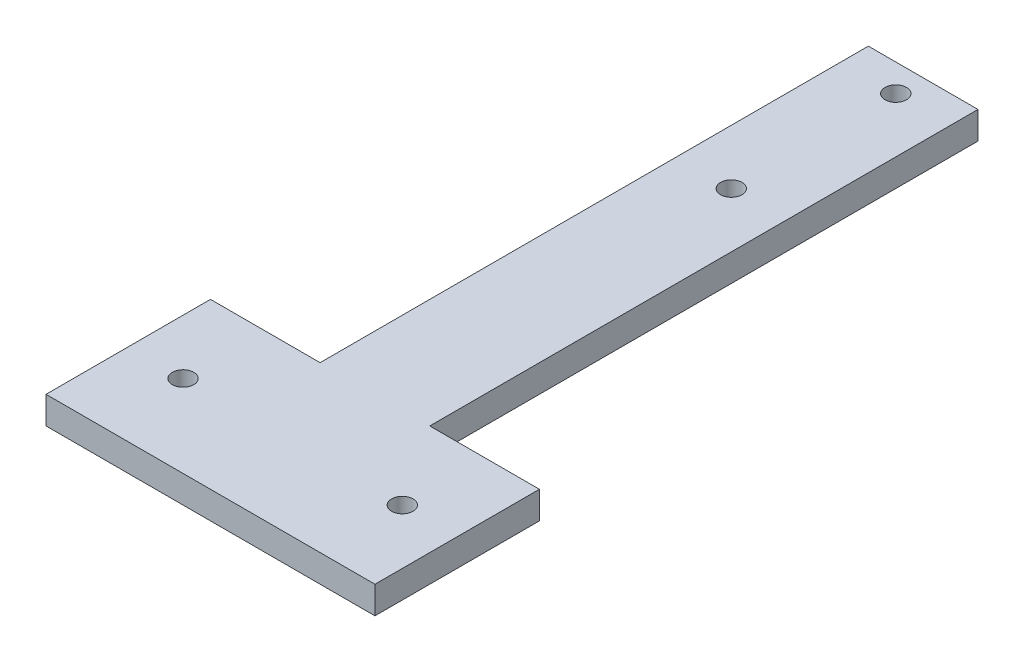
ISO-10303-21;
HEADER;
FILE_DESCRIPTION(('STEP AP214'),'2;1');
FILE_NAME('part.step','',(''),(''),'','','');
FILE_SCHEMA(('AUTOMOTIVE_DESIGN { 1 0 10303 214 1 1 1 1 }'));
ENDSEC;
DATA;
#1=APPLICATION_CONTEXT('core data for automotive mechanical design processes');
#2=APPLICATION_PROTOCOL_DEFINITION('international standard','automotive_design',2000,#1);
#3=PRODUCT_CONTEXT('',#1,'mechanical');
#4=PRODUCT('Part','Part','',(#3));
#5=PRODUCT_RELATED_PRODUCT_CATEGORY('part','',(#4));
#6=PRODUCT_DEFINITION_FORMATION('','',#4);
#7=PRODUCT_DEFINITION_CONTEXT('part definition',#1,'design');
#8=PRODUCT_DEFINITION('design','',#6,#7);
#9=PRODUCT_DEFINITION_SHAPE('','',#8);
#10=(LENGTH_UNIT() NAMED_UNIT(*) SI_UNIT(.MILLI.,.METRE.));
#11=(NAMED_UNIT(*) PLANE_ANGLE_UNIT() SI_UNIT($,.RADIAN.));
#12=(NAMED_UNIT(*) SI_UNIT($,.STERADIAN.) SOLID_ANGLE_UNIT());
#13=UNCERTAINTY_MEASURE_WITH_UNIT(LENGTH_MEASURE(1.E-05),#10,'distance_accuracy_value','');
#14=(GEOMETRIC_REPRESENTATION_CONTEXT(3) GLOBAL_UNCERTAINTY_ASSIGNED_CONTEXT((#13)) GLOBAL_UNIT_ASSIGNED_CONTEXT((#10,
#11,#12)) REPRESENTATION_CONTEXT('',''));
#15=CARTESIAN_POINT('',(0.,0.,0.));
#16=DIRECTION('',(0.,0.,1.));
#17=DIRECTION('',(1.,0.,0.));
#18=AXIS2_PLACEMENT_3D('',#15,#16,#17);
#19=CARTESIAN_POINT('',(0.,6.35,0.));
#20=DIRECTION('',(0.,1.,0.));
#21=DIRECTION('',(0.,0.,1.));
#22=AXIS2_PLACEMENT_3D('',#19,#20,#21);
#23=PLANE('',#22);
#24=CARTESIAN_POINT('',(0.,6.35,-158.75));
#25=DIRECTION('',(0.,1.,0.));
#26=DIRECTION('',(0.,0.,1.));
#27=AXIS2_PLACEMENT_3D('',#24,#25,#26);
#28=CIRCLE('',#27,2.48920000000003);
#29=CARTESIAN_POINT('',(0.,6.35,-156.2608));
#30=VERTEX_POINT('',#29);
#31=EDGE_CURVE('E189',#30,#30,#28,.T.);
#32=ORIENTED_EDGE('',*,*,#31,.F.);
#33=EDGE_LOOP('',(#32));
#34=FACE_BOUND('',#33,.T.);
#35=CARTESIAN_POINT('',(-25.4,6.35,-19.05));
#36=DIRECTION('',(0.,1.,0.));
#37=DIRECTION('',(0.,0.,1.));
#38=AXIS2_PLACEMENT_3D('',#35,#36,#37);
#39=CIRCLE('',#38,2.4892);
#40=CARTESIAN_POINT('',(-25.4,6.35,-16.5608));
#41=VERTEX_POINT('',#40);
#42=EDGE_CURVE('E135',#41,#41,#39,.T.);
#43=ORIENTED_EDGE('',*,*,#42,.F.);
#44=EDGE_LOOP('',(#43));
#45=FACE_BOUND('',#44,.T.);
#46=DIRECTION('',(-1.,0.,0.));
#47=VECTOR('',#46,1.);
#48=CARTESIAN_POINT('',(12.7,6.35,-165.1));
#49=LINE('',#48,#47);
#50=CARTESIAN_POINT('',(12.7,6.35,-165.1));
#51=VERTEX_POINT('',#50);
#52=CARTESIAN_POINT('',(-12.7,6.35,-165.1));
#53=VERTEX_POINT('',#52);
#54=EDGE_CURVE('E146',#51,#53,#49,.T.);
#55=ORIENTED_EDGE('',*,*,#54,.T.);
#56=DIRECTION('',(0.,0.,1.));
#57=VECTOR('',#56,1.);
#58=CARTESIAN_POINT('',(-12.7,6.35,-165.1));
#59=LINE('',#58,#57);
#60=CARTESIAN_POINT('',(-12.7,6.35,-38.1));
#61=VERTEX_POINT('',#60);
#62=EDGE_CURVE('E94',#53,#61,#59,.T.);
#63=ORIENTED_EDGE('',*,*,#62,.T.);
#64=DIRECTION('',(-1.,0.,0.));
#65=VECTOR('',#64,1.);
#66=CARTESIAN_POINT('',(-12.7,6.35,-38.1));
#67=LINE('',#66,#65);
#68=CARTESIAN_POINT('',(-38.1,6.35,-38.1));
#69=VERTEX_POINT('',#68);
#70=EDGE_CURVE('E161',#61,#69,#67,.T.);
#71=ORIENTED_EDGE('',*,*,#70,.T.);
#72=DIRECTION('',(0.,0.,1.));
#73=VECTOR('',#72,1.);
#74=CARTESIAN_POINT('',(-38.1,6.35,-38.1));
#75=LINE('',#74,#73);
#76=CARTESIAN_POINT('',(-38.1,6.35,0.));
#77=VERTEX_POINT('',#76);
#78=EDGE_CURVE('E174',#69,#77,#75,.T.);
#79=ORIENTED_EDGE('',*,*,#78,.T.);
#80=DIRECTION('',(1.,0.,0.));
#81=VECTOR('',#80,1.);
#82=CARTESIAN_POINT('',(-38.1,6.35,0.));
#83=LINE('',#82,#81);
#84=CARTESIAN_POINT('',(38.1,6.35,0.));
#85=VERTEX_POINT('',#84);
#86=EDGE_CURVE('E113',#77,#85,#83,.T.);
#87=ORIENTED_EDGE('',*,*,#86,.T.);
#88=DIRECTION('',(0.,0.,-1.));
#89=VECTOR('',#88,1.);
#90=CARTESIAN_POINT('',(38.1,6.35,0.));
#91=LINE('',#90,#89);
#92=CARTESIAN_POINT('',(38.1,6.35,-38.1));
#93=VERTEX_POINT('',#92);
#94=EDGE_CURVE('E107',#85,#93,#91,.T.);
#95=ORIENTED_EDGE('',*,*,#94,.T.);
#96=DIRECTION('',(-1.,0.,0.));
#97=VECTOR('',#96,1.);
#98=CARTESIAN_POINT('',(38.1,6.35,-38.1));
#99=LINE('',#98,#97);
#100=CARTESIAN_POINT('',(12.7,6.35,-38.1));
#101=VERTEX_POINT('',#100);
#102=EDGE_CURVE('E111',#93,#101,#99,.T.);
#103=ORIENTED_EDGE('',*,*,#102,.T.);
#104=DIRECTION('',(0.,0.,-1.));
#105=VECTOR('',#104,1.);
#106=CARTESIAN_POINT('',(12.7,6.35,-38.1));
#107=LINE('',#106,#105);
#108=EDGE_CURVE('E51',#101,#51,#107,.T.);
#109=ORIENTED_EDGE('',*,*,#108,.T.);
#110=EDGE_LOOP('',(#55,#63,#71,#79,#87,#95,#103,#109));
#111=FACE_BOUND('',#110,.T.);
#112=CARTESIAN_POINT('',(25.4,6.35,-19.05));
#113=DIRECTION('',(0.,1.,0.));
#114=DIRECTION('',(0.,0.,1.));
#115=AXIS2_PLACEMENT_3D('',#112,#113,#114);
#116=CIRCLE('',#115,2.4892);
#117=CARTESIAN_POINT('',(25.4,6.35,-16.5608));
#118=VERTEX_POINT('',#117);
#119=EDGE_CURVE('E183',#118,#118,#116,.T.);
#120=ORIENTED_EDGE('',*,*,#119,.F.);
#121=EDGE_LOOP('',(#120));
#122=FACE_BOUND('',#121,.T.);
#123=CARTESIAN_POINT('',(0.,6.35,-120.65));
#124=DIRECTION('',(0.,1.,0.));
#125=DIRECTION('',(0.,0.,1.));
#126=AXIS2_PLACEMENT_3D('',#123,#124,#125);
#127=CIRCLE('',#126,2.4892);
#128=CARTESIAN_POINT('',(0.,6.35,-118.1608));
#129=VERTEX_POINT('',#128);
#130=EDGE_CURVE('E195',#129,#129,#127,.T.);
#131=ORIENTED_EDGE('',*,*,#130,.F.);
#132=EDGE_LOOP('',(#131));
#133=FACE_BOUND('',#132,.T.);
#134=ADVANCED_FACE('F34',(#34,#45,#111,#122,#133),#23,.T.);
#135=CARTESIAN_POINT('',(0.,0.,0.));
#136=DIRECTION('',(0.,1.,0.));
#137=DIRECTION('',(0.,0.,1.));
#138=AXIS2_PLACEMENT_3D('',#135,#136,#137);
#139=PLANE('',#138);
#140=DIRECTION('',(-1.,0.,0.));
#141=VECTOR('',#140,1.);
#142=CARTESIAN_POINT('',(12.7,0.,-165.1));
#143=LINE('',#142,#141);
#144=CARTESIAN_POINT('',(12.7,0.,-165.1));
#145=VERTEX_POINT('',#144);
#146=CARTESIAN_POINT('',(-12.7,0.,-165.1));
#147=VERTEX_POINT('',#146);
#148=EDGE_CURVE('E131',#145,#147,#143,.T.);
#149=ORIENTED_EDGE('',*,*,#148,.F.);
#150=DIRECTION('',(0.,0.,-1.));
#151=VECTOR('',#150,1.);
#152=CARTESIAN_POINT('',(12.7,0.,-38.1));
#153=LINE('',#152,#151);
#154=CARTESIAN_POINT('',(12.7,0.,-38.1));
#155=VERTEX_POINT('',#154);
#156=EDGE_CURVE('E86',#155,#145,#153,.T.);
#157=ORIENTED_EDGE('',*,*,#156,.F.);
#158=DIRECTION('',(-1.,0.,0.));
#159=VECTOR('',#158,1.);
#160=CARTESIAN_POINT('',(38.1,0.,-38.1));
#161=LINE('',#160,#159);
#162=CARTESIAN_POINT('',(38.1,0.,-38.1));
#163=VERTEX_POINT('',#162);
#164=EDGE_CURVE('E80',#163,#155,#161,.T.);
#165=ORIENTED_EDGE('',*,*,#164,.F.);
#166=DIRECTION('',(0.,0.,-1.));
#167=VECTOR('',#166,1.);
#168=CARTESIAN_POINT('',(38.1,0.,0.));
#169=LINE('',#168,#167);
#170=CARTESIAN_POINT('',(38.1,0.,0.));
#171=VERTEX_POINT('',#170);
#172=EDGE_CURVE('E121',#171,#163,#169,.T.);
#173=ORIENTED_EDGE('',*,*,#172,.F.);
#174=DIRECTION('',(1.,0.,0.));
#175=VECTOR('',#174,1.);
#176=CARTESIAN_POINT('',(-38.1,0.,0.));
#177=LINE('',#176,#175);
#178=CARTESIAN_POINT('',(-38.1,0.,0.));
#179=VERTEX_POINT('',#178);
#180=EDGE_CURVE('E141',#179,#171,#177,.T.);
#181=ORIENTED_EDGE('',*,*,#180,.F.);
#182=DIRECTION('',(0.,0.,1.));
#183=VECTOR('',#182,1.);
#184=CARTESIAN_POINT('',(-38.1,0.,-38.1));
#185=LINE('',#184,#183);
#186=CARTESIAN_POINT('',(-38.1,0.,-38.1));
#187=VERTEX_POINT('',#186);
#188=EDGE_CURVE('E139',#187,#179,#185,.T.);
#189=ORIENTED_EDGE('',*,*,#188,.F.);
#190=DIRECTION('',(-1.,0.,0.));
#191=VECTOR('',#190,1.);
#192=CARTESIAN_POINT('',(-12.7,0.,-38.1));
#193=LINE('',#192,#191);
#194=CARTESIAN_POINT('',(-12.7,0.,-38.1));
#195=VERTEX_POINT('',#194);
#196=EDGE_CURVE('E137',#195,#187,#193,.T.);
#197=ORIENTED_EDGE('',*,*,#196,.F.);
#198=DIRECTION('',(0.,0.,1.));
#199=VECTOR('',#198,1.);
#200=CARTESIAN_POINT('',(-12.7,0.,-165.1));
#201=LINE('',#200,#199);
#202=EDGE_CURVE('E134',#147,#195,#201,.T.);
#203=ORIENTED_EDGE('',*,*,#202,.F.);
#204=EDGE_LOOP('',(#149,#157,#165,#173,#181,#189,#197,#203));
#205=FACE_BOUND('',#204,.T.);
#206=CARTESIAN_POINT('',(-25.4,0.,-19.05));
#207=DIRECTION('',(0.,1.,0.));
#208=DIRECTION('',(0.,0.,1.));
#209=AXIS2_PLACEMENT_3D('',#206,#207,#208);
#210=CIRCLE('',#209,2.4892);
#211=CARTESIAN_POINT('',(-25.4,0.,-16.5608));
#212=VERTEX_POINT('',#211);
#213=EDGE_CURVE('E180',#212,#212,#210,.T.);
#214=ORIENTED_EDGE('',*,*,#213,.T.);
#215=EDGE_LOOP('',(#214));
#216=FACE_BOUND('',#215,.T.);
#217=CARTESIAN_POINT('',(25.4,0.,-19.05));
#218=DIRECTION('',(0.,1.,0.));
#219=DIRECTION('',(0.,0.,1.));
#220=AXIS2_PLACEMENT_3D('',#217,#218,#219);
#221=CIRCLE('',#220,2.4892);
#222=CARTESIAN_POINT('',(25.4,0.,-16.5608));
#223=VERTEX_POINT('',#222);
#224=EDGE_CURVE('E186',#223,#223,#221,.T.);
#225=ORIENTED_EDGE('',*,*,#224,.T.);
#226=EDGE_LOOP('',(#225));
#227=FACE_BOUND('',#226,.T.);
#228=CARTESIAN_POINT('',(0.,0.,-158.75));
#229=DIRECTION('',(0.,1.,0.));
#230=DIRECTION('',(0.,0.,1.));
#231=AXIS2_PLACEMENT_3D('',#228,#229,#230);
#232=CIRCLE('',#231,2.48920000000003);
#233=CARTESIAN_POINT('',(0.,0.,-156.2608));
#234=VERTEX_POINT('',#233);
#235=EDGE_CURVE('E192',#234,#234,#232,.T.);
#236=ORIENTED_EDGE('',*,*,#235,.T.);
#237=EDGE_LOOP('',(#236));
#238=FACE_BOUND('',#237,.T.);
#239=CARTESIAN_POINT('',(0.,0.,-120.65));
#240=DIRECTION('',(0.,1.,0.));
#241=DIRECTION('',(0.,0.,1.));
#242=AXIS2_PLACEMENT_3D('',#239,#240,#241);
#243=CIRCLE('',#242,2.4892);
#244=CARTESIAN_POINT('',(0.,0.,-118.1608));
#245=VERTEX_POINT('',#244);
#246=EDGE_CURVE('E198',#245,#245,#243,.T.);
#247=ORIENTED_EDGE('',*,*,#246,.T.);
#248=EDGE_LOOP('',(#247));
#249=FACE_BOUND('',#248,.T.);
#250=ADVANCED_FACE('F165',(#205,#216,#227,#238,#249),#139,.F.);
#251=CARTESIAN_POINT('',(12.7,6.35,-165.1));
#252=DIRECTION('',(0.,0.,1.));
#253=DIRECTION('',(1.,0.,0.));
#254=AXIS2_PLACEMENT_3D('',#251,#252,#253);
#255=PLANE('',#254);
#256=ORIENTED_EDGE('',*,*,#148,.T.);
#257=DIRECTION('',(0.,-1.,0.));
#258=VECTOR('',#257,1.);
#259=CARTESIAN_POINT('',(-12.7,6.35,-165.1));
#260=LINE('',#259,#258);
#261=EDGE_CURVE('E11',#53,#147,#260,.T.);
#262=ORIENTED_EDGE('',*,*,#261,.F.);
#263=ORIENTED_EDGE('',*,*,#54,.F.);
#264=DIRECTION('',(0.,-1.,0.));
#265=VECTOR('',#264,1.);
#266=CARTESIAN_POINT('',(12.7,6.35,-165.1));
#267=LINE('',#266,#265);
#268=EDGE_CURVE('E127',#51,#145,#267,.T.);
#269=ORIENTED_EDGE('',*,*,#268,.T.);
#270=EDGE_LOOP('',(#256,#262,#263,#269));
#271=FACE_BOUND('',#270,.T.);
#272=ADVANCED_FACE('F36',(#271),#255,.F.);
#273=CARTESIAN_POINT('',(-12.7,6.35,-165.1));
#274=DIRECTION('',(1.,0.,0.));
#275=DIRECTION('',(0.,0.,-1.));
#276=AXIS2_PLACEMENT_3D('',#273,#274,#275);
#277=PLANE('',#276);
#278=ORIENTED_EDGE('',*,*,#202,.T.);
#279=DIRECTION('',(0.,-1.,0.));
#280=VECTOR('',#279,1.);
#281=CARTESIAN_POINT('',(-12.7,6.35,-38.1));
#282=LINE('',#281,#280);
#283=EDGE_CURVE('E43',#61,#195,#282,.T.);
#284=ORIENTED_EDGE('',*,*,#283,.F.);
#285=ORIENTED_EDGE('',*,*,#62,.F.);
#286=ORIENTED_EDGE('',*,*,#261,.T.);
#287=EDGE_LOOP('',(#278,#284,#285,#286));
#288=FACE_BOUND('',#287,.T.);
#289=ADVANCED_FACE('F232',(#288),#277,.F.);
#290=CARTESIAN_POINT('',(-12.7,6.35,-38.1));
#291=DIRECTION('',(0.,0.,1.));
#292=DIRECTION('',(1.,0.,0.));
#293=AXIS2_PLACEMENT_3D('',#290,#291,#292);
#294=PLANE('',#293);
#295=ORIENTED_EDGE('',*,*,#196,.T.);
#296=DIRECTION('',(0.,-1.,0.));
#297=VECTOR('',#296,1.);
#298=CARTESIAN_POINT('',(-38.1,6.35,-38.1));
#299=LINE('',#298,#297);
#300=EDGE_CURVE('E153',#69,#187,#299,.T.);
#301=ORIENTED_EDGE('',*,*,#300,.F.);
#302=ORIENTED_EDGE('',*,*,#70,.F.);
#303=ORIENTED_EDGE('',*,*,#283,.T.);
#304=EDGE_LOOP('',(#295,#301,#302,#303));
#305=FACE_BOUND('',#304,.T.);
#306=ADVANCED_FACE('F159',(#305),#294,.F.);
#307=CARTESIAN_POINT('',(-38.1,6.35,-38.1));
#308=DIRECTION('',(1.,0.,0.));
#309=DIRECTION('',(0.,0.,-1.));
#310=AXIS2_PLACEMENT_3D('',#307,#308,#309);
#311=PLANE('',#310);
#312=ORIENTED_EDGE('',*,*,#188,.T.);
#313=DIRECTION('',(0.,-1.,0.));
#314=VECTOR('',#313,1.);
#315=CARTESIAN_POINT('',(-38.1,6.35,0.));
#316=LINE('',#315,#314);
#317=EDGE_CURVE('E150',#77,#179,#316,.T.);
#318=ORIENTED_EDGE('',*,*,#317,.F.);
#319=ORIENTED_EDGE('',*,*,#78,.F.);
#320=ORIENTED_EDGE('',*,*,#300,.T.);
#321=EDGE_LOOP('',(#312,#318,#319,#320));
#322=FACE_BOUND('',#321,.T.);
#323=ADVANCED_FACE('F170',(#322),#311,.F.);
#324=CARTESIAN_POINT('',(-38.1,6.35,0.));
#325=DIRECTION('',(0.,0.,-1.));
#326=DIRECTION('',(-1.,0.,0.));
#327=AXIS2_PLACEMENT_3D('',#324,#325,#326);
#328=PLANE('',#327);
#329=ORIENTED_EDGE('',*,*,#180,.T.);
#330=DIRECTION('',(0.,-1.,0.));
#331=VECTOR('',#330,1.);
#332=CARTESIAN_POINT('',(38.1,6.35,0.));
#333=LINE('',#332,#331);
#334=EDGE_CURVE('E122',#85,#171,#333,.T.);
#335=ORIENTED_EDGE('',*,*,#334,.F.);
#336=ORIENTED_EDGE('',*,*,#86,.F.);
#337=ORIENTED_EDGE('',*,*,#317,.T.);
#338=EDGE_LOOP('',(#329,#335,#336,#337));
#339=FACE_BOUND('',#338,.T.);
#340=ADVANCED_FACE('F173',(#339),#328,.F.);
#341=CARTESIAN_POINT('',(38.1,6.35,0.));
#342=DIRECTION('',(-1.,0.,0.));
#343=DIRECTION('',(0.,0.,1.));
#344=AXIS2_PLACEMENT_3D('',#341,#342,#343);
#345=PLANE('',#344);
#346=ORIENTED_EDGE('',*,*,#172,.T.);
#347=DIRECTION('',(0.,-1.,0.));
#348=VECTOR('',#347,1.);
#349=CARTESIAN_POINT('',(38.1,6.35,-38.1));
#350=LINE('',#349,#348);
#351=EDGE_CURVE('E118',#93,#163,#350,.T.);
#352=ORIENTED_EDGE('',*,*,#351,.F.);
#353=ORIENTED_EDGE('',*,*,#94,.F.);
#354=ORIENTED_EDGE('',*,*,#334,.T.);
#355=EDGE_LOOP('',(#346,#352,#353,#354));
#356=FACE_BOUND('',#355,.T.);
#357=ADVANCED_FACE('F119',(#356),#345,.F.);
#358=CARTESIAN_POINT('',(38.1,6.35,-38.1));
#359=DIRECTION('',(0.,0.,1.));
#360=DIRECTION('',(1.,0.,0.));
#361=AXIS2_PLACEMENT_3D('',#358,#359,#360);
#362=PLANE('',#361);
#363=ORIENTED_EDGE('',*,*,#164,.T.);
#364=DIRECTION('',(0.,-1.,0.));
#365=VECTOR('',#364,1.);
#366=CARTESIAN_POINT('',(12.7,6.35,-38.1));
#367=LINE('',#366,#365);
#368=EDGE_CURVE('E123',#101,#155,#367,.T.);
#369=ORIENTED_EDGE('',*,*,#368,.F.);
#370=ORIENTED_EDGE('',*,*,#102,.F.);
#371=ORIENTED_EDGE('',*,*,#351,.T.);
#372=EDGE_LOOP('',(#363,#369,#370,#371));
#373=FACE_BOUND('',#372,.T.);
#374=ADVANCED_FACE('F125',(#373),#362,.F.);
#375=CARTESIAN_POINT('',(12.7,6.35,-38.1));
#376=DIRECTION('',(-1.,0.,0.));
#377=DIRECTION('',(0.,0.,1.));
#378=AXIS2_PLACEMENT_3D('',#375,#376,#377);
#379=PLANE('',#378);
#380=ORIENTED_EDGE('',*,*,#156,.T.);
#381=ORIENTED_EDGE('',*,*,#268,.F.);
#382=ORIENTED_EDGE('',*,*,#108,.F.);
#383=ORIENTED_EDGE('',*,*,#368,.T.);
#384=EDGE_LOOP('',(#380,#381,#382,#383));
#385=FACE_BOUND('',#384,.T.);
#386=ADVANCED_FACE('F220',(#385),#379,.F.);
#387=CARTESIAN_POINT('',(-25.4,6.35,-19.05));
#388=DIRECTION('',(0.,-1.,0.));
#389=DIRECTION('',(0.,0.,-1.));
#390=AXIS2_PLACEMENT_3D('',#387,#388,#389);
#391=CYLINDRICAL_SURFACE('',#390,2.4892);
#392=ORIENTED_EDGE('',*,*,#42,.T.);
#393=EDGE_LOOP('',(#392));
#394=FACE_BOUND('',#393,.T.);
#395=ORIENTED_EDGE('',*,*,#213,.F.);
#396=EDGE_LOOP('',(#395));
#397=FACE_BOUND('',#396,.T.);
#398=ADVANCED_FACE('F217',(#394,#397),#391,.F.);
#399=CARTESIAN_POINT('',(25.4,6.35,-19.05));
#400=DIRECTION('',(0.,-1.,0.));
#401=DIRECTION('',(0.,0.,-1.));
#402=AXIS2_PLACEMENT_3D('',#399,#400,#401);
#403=CYLINDRICAL_SURFACE('',#402,2.4892);
#404=ORIENTED_EDGE('',*,*,#119,.T.);
#405=EDGE_LOOP('',(#404));
#406=FACE_BOUND('',#405,.T.);
#407=ORIENTED_EDGE('',*,*,#224,.F.);
#408=EDGE_LOOP('',(#407));
#409=FACE_BOUND('',#408,.T.);
#410=ADVANCED_FACE('F296',(#406,#409),#403,.F.);
#411=CARTESIAN_POINT('',(0.,6.35,-158.75));
#412=DIRECTION('',(0.,-1.,0.));
#413=DIRECTION('',(0.,0.,-1.));
#414=AXIS2_PLACEMENT_3D('',#411,#412,#413);
#415=CYLINDRICAL_SURFACE('',#414,2.48920000000003);
#416=ORIENTED_EDGE('',*,*,#31,.T.);
#417=EDGE_LOOP('',(#416));
#418=FACE_BOUND('',#417,.T.);
#419=ORIENTED_EDGE('',*,*,#235,.F.);
#420=EDGE_LOOP('',(#419));
#421=FACE_BOUND('',#420,.T.);
#422=ADVANCED_FACE('F304',(#418,#421),#415,.F.);
#423=CARTESIAN_POINT('',(0.,6.35,-120.65));
#424=DIRECTION('',(0.,-1.,0.));
#425=DIRECTION('',(0.,0.,-1.));
#426=AXIS2_PLACEMENT_3D('',#423,#424,#425);
#427=CYLINDRICAL_SURFACE('',#426,2.4892);
#428=ORIENTED_EDGE('',*,*,#130,.T.);
#429=EDGE_LOOP('',(#428));
#430=FACE_BOUND('',#429,.T.);
#431=ORIENTED_EDGE('',*,*,#246,.F.);
#432=EDGE_LOOP('',(#431));
#433=FACE_BOUND('',#432,.T.);
#434=ADVANCED_FACE('F204',(#430,#433),#427,.F.);
#435=CLOSED_SHELL('',(#134,#250,#272,#289,#306,#323,#340,#357,#374,#386,#398,#410,#422,#434));
#436=MANIFOLD_SOLID_BREP('B2',#435);
#437=ADVANCED_BREP_SHAPE_REPRESENTATION('',(#18,#436),#14);
#438=SHAPE_DEFINITION_REPRESENTATION(#9,#437);
ENDSEC;
END-ISO-10303-21;
